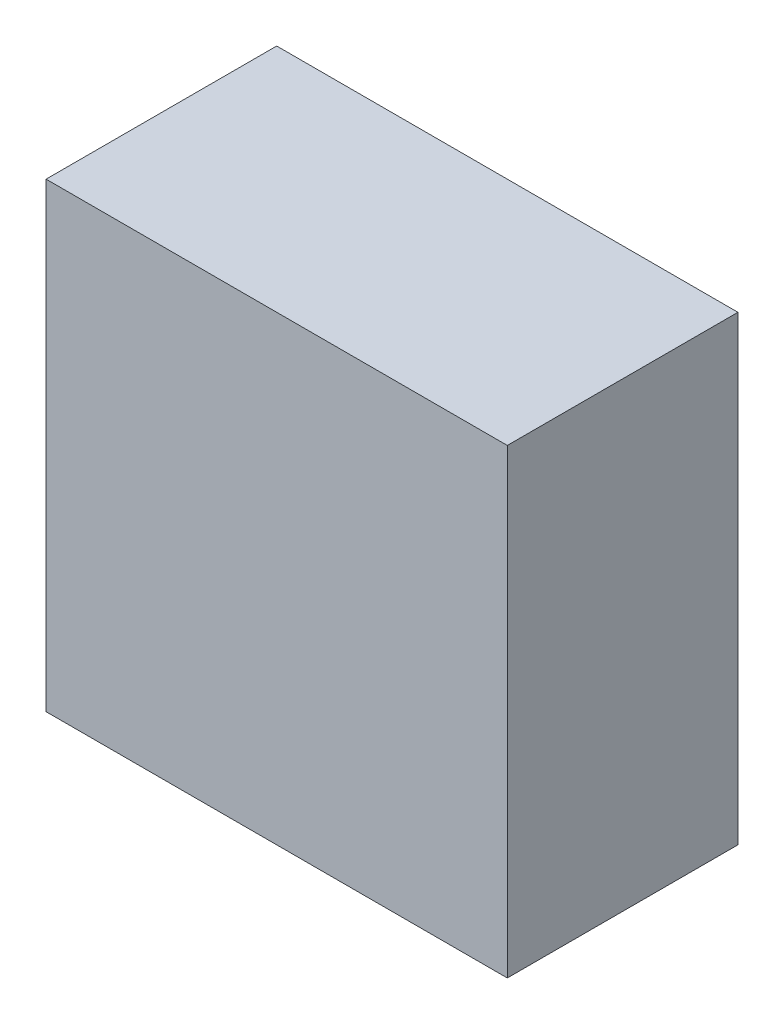
ISO-10303-21;
HEADER;
FILE_DESCRIPTION(('STEP AP214'),'2;1');
FILE_NAME('part.step','',(''),(''),'','','');
FILE_SCHEMA(('AUTOMOTIVE_DESIGN { 1 0 10303 214 1 1 1 1 }'));
ENDSEC;
DATA;
#1=APPLICATION_CONTEXT('core data for automotive mechanical design processes');
#2=APPLICATION_PROTOCOL_DEFINITION('international standard','automotive_design',2000,#1);
#3=PRODUCT_CONTEXT('',#1,'mechanical');
#4=PRODUCT('Part','Part','',(#3));
#5=PRODUCT_RELATED_PRODUCT_CATEGORY('part','',(#4));
#6=PRODUCT_DEFINITION_FORMATION('','',#4);
#7=PRODUCT_DEFINITION_CONTEXT('part definition',#1,'design');
#8=PRODUCT_DEFINITION('design','',#6,#7);
#9=PRODUCT_DEFINITION_SHAPE('','',#8);
#10=(LENGTH_UNIT() NAMED_UNIT(*) SI_UNIT(.MILLI.,.METRE.));
#11=(NAMED_UNIT(*) PLANE_ANGLE_UNIT() SI_UNIT($,.RADIAN.));
#12=(NAMED_UNIT(*) SI_UNIT($,.STERADIAN.) SOLID_ANGLE_UNIT());
#13=UNCERTAINTY_MEASURE_WITH_UNIT(LENGTH_MEASURE(1.E-05),#10,'distance_accuracy_value','');
#14=(GEOMETRIC_REPRESENTATION_CONTEXT(3) GLOBAL_UNCERTAINTY_ASSIGNED_CONTEXT((#13)) GLOBAL_UNIT_ASSIGNED_CONTEXT((#10,
#11,#12)) REPRESENTATION_CONTEXT('',''));
#15=CARTESIAN_POINT('',(0.,0.,0.));
#16=DIRECTION('',(0.,0.,1.));
#17=DIRECTION('',(1.,0.,0.));
#18=AXIS2_PLACEMENT_3D('',#15,#16,#17);
#19=CARTESIAN_POINT('',(0.,0.,2.75));
#20=DIRECTION('',(0.,0.,-1.));
#21=DIRECTION('',(-1.,0.,0.));
#22=AXIS2_PLACEMENT_3D('',#19,#20,#21);
#23=PLANE('',#22);
#24=DIRECTION('',(1.,0.,0.));
#25=VECTOR('',#24,1.);
#26=CARTESIAN_POINT('',(-38.,165.941489418563,2.75));
#27=LINE('',#26,#25);
#28=CARTESIAN_POINT('',(-42.,165.941489418563,2.75));
#29=VERTEX_POINT('',#28);
#30=CARTESIAN_POINT('',(-38.,165.941489418563,2.75));
#31=VERTEX_POINT('',#30);
#32=EDGE_CURVE('E80',#29,#31,#27,.T.);
#33=ORIENTED_EDGE('',*,*,#32,.T.);
#34=DIRECTION('',(0.,1.,0.));
#35=VECTOR('',#34,1.);
#36=CARTESIAN_POINT('',(-38.,169.941489418563,2.75));
#37=LINE('',#36,#35);
#38=CARTESIAN_POINT('',(-38.,169.941489418563,2.75));
#39=VERTEX_POINT('',#38);
#40=EDGE_CURVE('E55',#31,#39,#37,.T.);
#41=ORIENTED_EDGE('',*,*,#40,.T.);
#42=DIRECTION('',(1.,0.,0.));
#43=VECTOR('',#42,1.);
#44=CARTESIAN_POINT('',(-38.,169.941489418563,2.75));
#45=LINE('',#44,#43);
#46=CARTESIAN_POINT('',(-42.,169.941489418563,2.75));
#47=VERTEX_POINT('',#46);
#48=EDGE_CURVE('E57',#39,#47,#45,.F.);
#49=ORIENTED_EDGE('',*,*,#48,.T.);
#50=DIRECTION('',(0.,1.,0.));
#51=VECTOR('',#50,1.);
#52=CARTESIAN_POINT('',(-42.,169.941489418563,2.75));
#53=LINE('',#52,#51);
#54=EDGE_CURVE('E20',#47,#29,#53,.F.);
#55=ORIENTED_EDGE('',*,*,#54,.T.);
#56=EDGE_LOOP('',(#33,#41,#49,#55));
#57=FACE_BOUND('',#56,.T.);
#58=ADVANCED_FACE('F17',(#57),#23,.F.);
#59=CARTESIAN_POINT('',(-42.,169.941489418563,2.75));
#60=DIRECTION('',(1.,0.,0.));
#61=DIRECTION('',(0.,0.,-1.));
#62=AXIS2_PLACEMENT_3D('',#59,#60,#61);
#63=PLANE('',#62);
#64=DIRECTION('',(0.,0.,1.));
#65=VECTOR('',#64,1.);
#66=CARTESIAN_POINT('',(-42.,165.941489418563,2.75));
#67=LINE('',#66,#65);
#68=CARTESIAN_POINT('',(-42.,165.941489418563,0.75));
#69=VERTEX_POINT('',#68);
#70=EDGE_CURVE('E68',#69,#29,#67,.T.);
#71=ORIENTED_EDGE('',*,*,#70,.T.);
#72=ORIENTED_EDGE('',*,*,#54,.F.);
#73=DIRECTION('',(0.,0.,-1.));
#74=VECTOR('',#73,1.);
#75=CARTESIAN_POINT('',(-42.,169.941489418563,2.75));
#76=LINE('',#75,#74);
#77=CARTESIAN_POINT('',(-42.,169.941489418563,0.75));
#78=VERTEX_POINT('',#77);
#79=EDGE_CURVE('E63',#47,#78,#76,.T.);
#80=ORIENTED_EDGE('',*,*,#79,.T.);
#81=DIRECTION('',(0.,1.,0.));
#82=VECTOR('',#81,1.);
#83=CARTESIAN_POINT('',(-42.,0.,0.75));
#84=LINE('',#83,#82);
#85=EDGE_CURVE('E83',#69,#78,#84,.T.);
#86=ORIENTED_EDGE('',*,*,#85,.F.);
#87=EDGE_LOOP('',(#71,#72,#80,#86));
#88=FACE_BOUND('',#87,.T.);
#89=ADVANCED_FACE('F65',(#88),#63,.F.);
#90=CARTESIAN_POINT('',(-38.,169.941489418563,2.75));
#91=DIRECTION('',(0.,-1.,0.));
#92=DIRECTION('',(0.,0.,-1.));
#93=AXIS2_PLACEMENT_3D('',#90,#91,#92);
#94=PLANE('',#93);
#95=ORIENTED_EDGE('',*,*,#79,.F.);
#96=ORIENTED_EDGE('',*,*,#48,.F.);
#97=DIRECTION('',(0.,0.,1.));
#98=VECTOR('',#97,1.);
#99=CARTESIAN_POINT('',(-38.,169.941489418563,2.75));
#100=LINE('',#99,#98);
#101=CARTESIAN_POINT('',(-38.,169.941489418563,0.75));
#102=VERTEX_POINT('',#101);
#103=EDGE_CURVE('E75',#39,#102,#100,.F.);
#104=ORIENTED_EDGE('',*,*,#103,.T.);
#105=DIRECTION('',(-1.,0.,0.));
#106=VECTOR('',#105,1.);
#107=CARTESIAN_POINT('',(0.,169.941489418563,0.75));
#108=LINE('',#107,#106);
#109=EDGE_CURVE('E72',#78,#102,#108,.F.);
#110=ORIENTED_EDGE('',*,*,#109,.F.);
#111=EDGE_LOOP('',(#95,#96,#104,#110));
#112=FACE_BOUND('',#111,.T.);
#113=ADVANCED_FACE('F70',(#112),#94,.F.);
#114=CARTESIAN_POINT('',(-38.,169.941489418563,2.75));
#115=DIRECTION('',(-1.,0.,0.));
#116=DIRECTION('',(0.,0.,1.));
#117=AXIS2_PLACEMENT_3D('',#114,#115,#116);
#118=PLANE('',#117);
#119=ORIENTED_EDGE('',*,*,#103,.F.);
#120=ORIENTED_EDGE('',*,*,#40,.F.);
#121=DIRECTION('',(0.,0.,1.));
#122=VECTOR('',#121,1.);
#123=CARTESIAN_POINT('',(-38.,165.941489418563,2.75));
#124=LINE('',#123,#122);
#125=CARTESIAN_POINT('',(-38.,165.941489418563,0.75));
#126=VERTEX_POINT('',#125);
#127=EDGE_CURVE('E35',#31,#126,#124,.F.);
#128=ORIENTED_EDGE('',*,*,#127,.T.);
#129=DIRECTION('',(0.,1.,0.));
#130=VECTOR('',#129,1.);
#131=CARTESIAN_POINT('',(-38.,0.,0.75));
#132=LINE('',#131,#130);
#133=EDGE_CURVE('E26',#102,#126,#132,.F.);
#134=ORIENTED_EDGE('',*,*,#133,.F.);
#135=EDGE_LOOP('',(#119,#120,#128,#134));
#136=FACE_BOUND('',#135,.T.);
#137=ADVANCED_FACE('F89',(#136),#118,.F.);
#138=CARTESIAN_POINT('',(-38.,165.941489418563,2.75));
#139=DIRECTION('',(0.,1.,0.));
#140=DIRECTION('',(0.,0.,1.));
#141=AXIS2_PLACEMENT_3D('',#138,#139,#140);
#142=PLANE('',#141);
#143=ORIENTED_EDGE('',*,*,#127,.F.);
#144=ORIENTED_EDGE('',*,*,#32,.F.);
#145=ORIENTED_EDGE('',*,*,#70,.F.);
#146=DIRECTION('',(-1.,0.,0.));
#147=VECTOR('',#146,1.);
#148=CARTESIAN_POINT('',(0.,165.941489418563,0.75));
#149=LINE('',#148,#147);
#150=EDGE_CURVE('E11',#126,#69,#149,.T.);
#151=ORIENTED_EDGE('',*,*,#150,.F.);
#152=EDGE_LOOP('',(#143,#144,#145,#151));
#153=FACE_BOUND('',#152,.T.);
#154=ADVANCED_FACE('F91',(#153),#142,.F.);
#155=CARTESIAN_POINT('',(0.,0.,0.75));
#156=DIRECTION('',(0.,0.,-1.));
#157=DIRECTION('',(-1.,0.,0.));
#158=AXIS2_PLACEMENT_3D('',#155,#156,#157);
#159=PLANE('',#158);
#160=ORIENTED_EDGE('',*,*,#133,.T.);
#161=ORIENTED_EDGE('',*,*,#150,.T.);
#162=ORIENTED_EDGE('',*,*,#85,.T.);
#163=ORIENTED_EDGE('',*,*,#109,.T.);
#164=EDGE_LOOP('',(#160,#161,#162,#163));
#165=FACE_BOUND('',#164,.T.);
#166=ADVANCED_FACE('F88',(#165),#159,.T.);
#167=CLOSED_SHELL('',(#58,#89,#113,#137,#154,#166));
#168=MANIFOLD_SOLID_BREP('B1',#167);
#169=ADVANCED_BREP_SHAPE_REPRESENTATION('',(#18,#168),#14);
#170=SHAPE_DEFINITION_REPRESENTATION(#9,#169);
ENDSEC;
END-ISO-10303-21;
